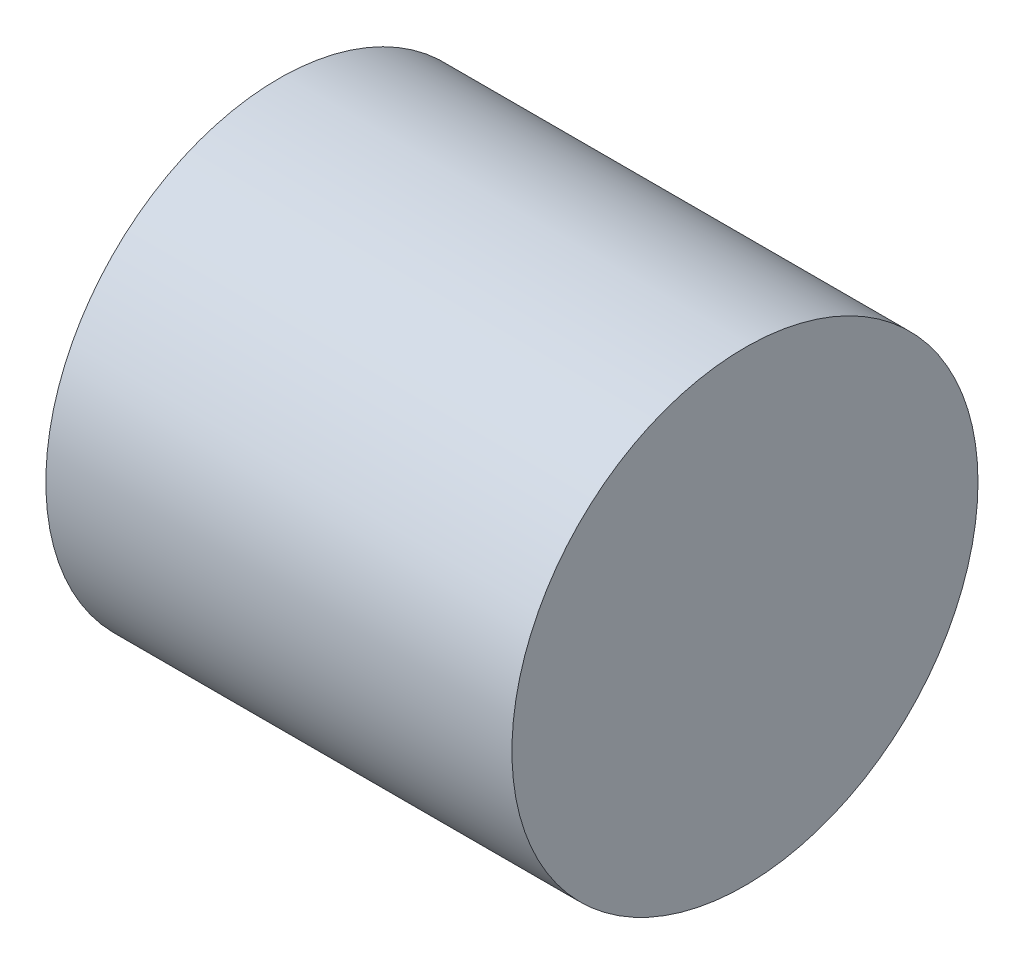
ISO-10303-21;
HEADER;
FILE_DESCRIPTION(('STEP AP214'),'2;1');
FILE_NAME('part.step','',(''),(''),'','','');
FILE_SCHEMA(('AUTOMOTIVE_DESIGN { 1 0 10303 214 1 1 1 1 }'));
ENDSEC;
DATA;
#1=APPLICATION_CONTEXT('core data for automotive mechanical design processes');
#2=APPLICATION_PROTOCOL_DEFINITION('international standard','automotive_design',2000,#1);
#3=PRODUCT_CONTEXT('',#1,'mechanical');
#4=PRODUCT('Part','Part','',(#3));
#5=PRODUCT_RELATED_PRODUCT_CATEGORY('part','',(#4));
#6=PRODUCT_DEFINITION_FORMATION('','',#4);
#7=PRODUCT_DEFINITION_CONTEXT('part definition',#1,'design');
#8=PRODUCT_DEFINITION('design','',#6,#7);
#9=PRODUCT_DEFINITION_SHAPE('','',#8);
#10=(LENGTH_UNIT() NAMED_UNIT(*) SI_UNIT(.MILLI.,.METRE.));
#11=(NAMED_UNIT(*) PLANE_ANGLE_UNIT() SI_UNIT($,.RADIAN.));
#12=(NAMED_UNIT(*) SI_UNIT($,.STERADIAN.) SOLID_ANGLE_UNIT());
#13=UNCERTAINTY_MEASURE_WITH_UNIT(LENGTH_MEASURE(1.E-05),#10,'distance_accuracy_value','');
#14=(GEOMETRIC_REPRESENTATION_CONTEXT(3) GLOBAL_UNCERTAINTY_ASSIGNED_CONTEXT((#13)) GLOBAL_UNIT_ASSIGNED_CONTEXT((#10,
#11,#12)) REPRESENTATION_CONTEXT('',''));
#15=CARTESIAN_POINT('',(0.,0.,0.));
#16=DIRECTION('',(0.,0.,1.));
#17=DIRECTION('',(1.,0.,0.));
#18=AXIS2_PLACEMENT_3D('',#15,#16,#17);
#19=CARTESIAN_POINT('',(3.175,0.,0.));
#20=DIRECTION('',(-1.,0.,0.));
#21=DIRECTION('',(0.,0.,1.));
#22=AXIS2_PLACEMENT_3D('',#19,#20,#21);
#23=CYLINDRICAL_SURFACE('',#22,1.5875);
#24=CARTESIAN_POINT('',(3.175,0.,0.));
#25=DIRECTION('',(1.,0.,0.));
#26=DIRECTION('',(0.,0.,-1.));
#27=AXIS2_PLACEMENT_3D('',#24,#25,#26);
#28=CIRCLE('',#27,1.5875);
#29=CARTESIAN_POINT('',(3.175,0.,-1.5875));
#30=VERTEX_POINT('',#29);
#31=EDGE_CURVE('E10',#30,#30,#28,.T.);
#32=ORIENTED_EDGE('',*,*,#31,.F.);
#33=EDGE_LOOP('',(#32));
#34=FACE_BOUND('',#33,.T.);
#35=CARTESIAN_POINT('',(0.,0.,0.));
#36=DIRECTION('',(1.,0.,0.));
#37=DIRECTION('',(0.,0.,-1.));
#38=AXIS2_PLACEMENT_3D('',#35,#36,#37);
#39=CIRCLE('',#38,1.5875);
#40=CARTESIAN_POINT('',(0.,0.,-1.5875));
#41=VERTEX_POINT('',#40);
#42=EDGE_CURVE('E34',#41,#41,#39,.T.);
#43=ORIENTED_EDGE('',*,*,#42,.T.);
#44=EDGE_LOOP('',(#43));
#45=FACE_BOUND('',#44,.T.);
#46=ADVANCED_FACE('F31',(#34,#45),#23,.T.);
#47=CARTESIAN_POINT('',(3.175,0.,0.));
#48=DIRECTION('',(1.,0.,0.));
#49=DIRECTION('',(0.,0.,-1.));
#50=AXIS2_PLACEMENT_3D('',#47,#48,#49);
#51=PLANE('',#50);
#52=ORIENTED_EDGE('',*,*,#31,.T.);
#53=EDGE_LOOP('',(#52));
#54=FACE_BOUND('',#53,.T.);
#55=ADVANCED_FACE('F46',(#54),#51,.T.);
#56=CARTESIAN_POINT('',(0.,0.,0.));
#57=DIRECTION('',(1.,0.,0.));
#58=DIRECTION('',(0.,0.,-1.));
#59=AXIS2_PLACEMENT_3D('',#56,#57,#58);
#60=PLANE('',#59);
#61=ORIENTED_EDGE('',*,*,#42,.F.);
#62=EDGE_LOOP('',(#61));
#63=FACE_BOUND('',#62,.T.);
#64=ADVANCED_FACE('F44',(#63),#60,.F.);
#65=CLOSED_SHELL('',(#46,#55,#64));
#66=MANIFOLD_SOLID_BREP('B2',#65);
#67=ADVANCED_BREP_SHAPE_REPRESENTATION('',(#18,#66),#14);
#68=SHAPE_DEFINITION_REPRESENTATION(#9,#67);
ENDSEC;
END-ISO-10303-21;
